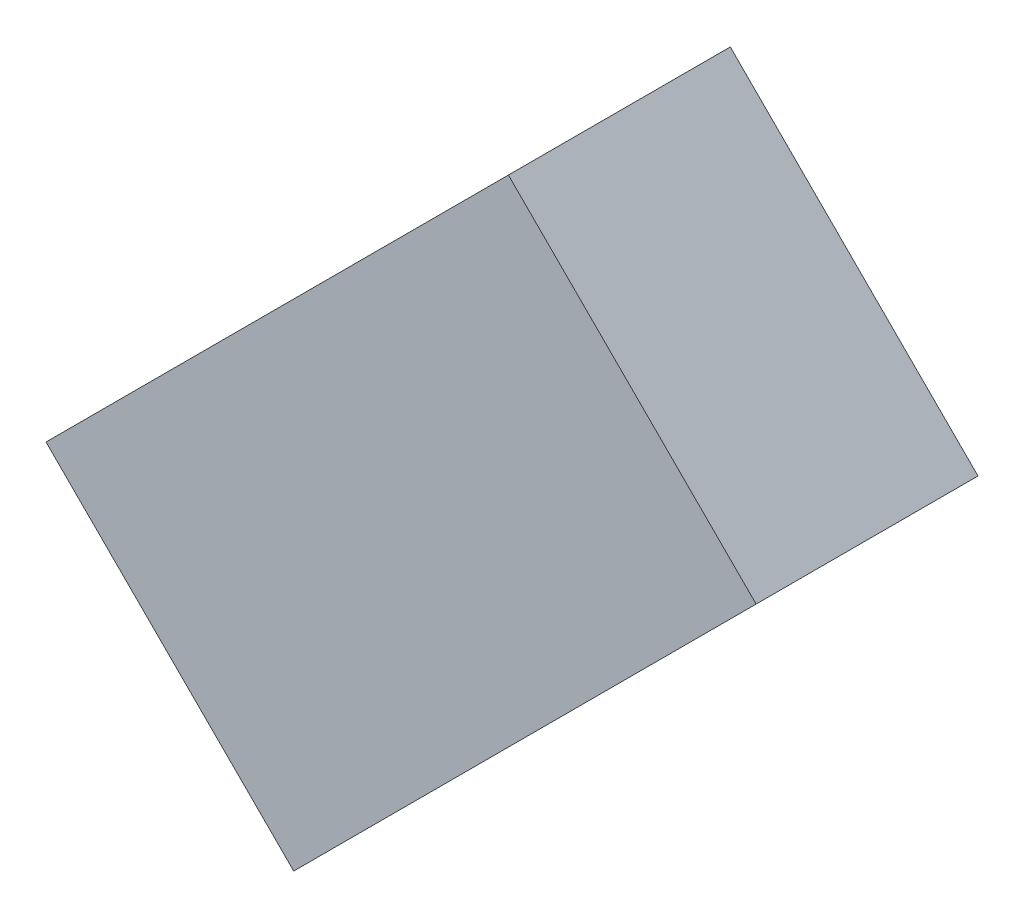
ISO-10303-21;
HEADER;
FILE_DESCRIPTION(('STEP AP214'),'2;1');
FILE_NAME('part.step','',(''),(''),'','','');
FILE_SCHEMA(('AUTOMOTIVE_DESIGN { 1 0 10303 214 1 1 1 1 }'));
ENDSEC;
DATA;
#1=APPLICATION_CONTEXT('core data for automotive mechanical design processes');
#2=APPLICATION_PROTOCOL_DEFINITION('international standard','automotive_design',2000,#1);
#3=PRODUCT_CONTEXT('',#1,'mechanical');
#4=PRODUCT('Part','Part','',(#3));
#5=PRODUCT_RELATED_PRODUCT_CATEGORY('part','',(#4));
#6=PRODUCT_DEFINITION_FORMATION('','',#4);
#7=PRODUCT_DEFINITION_CONTEXT('part definition',#1,'design');
#8=PRODUCT_DEFINITION('design','',#6,#7);
#9=PRODUCT_DEFINITION_SHAPE('','',#8);
#10=(LENGTH_UNIT() NAMED_UNIT(*) SI_UNIT(.MILLI.,.METRE.));
#11=(NAMED_UNIT(*) PLANE_ANGLE_UNIT() SI_UNIT($,.RADIAN.));
#12=(NAMED_UNIT(*) SI_UNIT($,.STERADIAN.) SOLID_ANGLE_UNIT());
#13=UNCERTAINTY_MEASURE_WITH_UNIT(LENGTH_MEASURE(1.E-05),#10,'distance_accuracy_value','');
#14=(GEOMETRIC_REPRESENTATION_CONTEXT(3) GLOBAL_UNCERTAINTY_ASSIGNED_CONTEXT((#13)) GLOBAL_UNIT_ASSIGNED_CONTEXT((#10,
#11,#12)) REPRESENTATION_CONTEXT('',''));
#15=CARTESIAN_POINT('',(0.,0.,0.));
#16=DIRECTION('',(0.,0.,1.));
#17=DIRECTION('',(1.,0.,0.));
#18=AXIS2_PLACEMENT_3D('',#15,#16,#17);
#19=CARTESIAN_POINT('',(7.707,8.644,0.81916));
#20=DIRECTION('',(0.,0.,1.));
#21=DIRECTION('',(1.,0.,0.));
#22=AXIS2_PLACEMENT_3D('',#19,#20,#21);
#23=PLANE('',#22);
#24=DIRECTION('',(0.707106781186548,-0.707106781186548,0.));
#25=VECTOR('',#24,1.);
#26=CARTESIAN_POINT('',(8.01105591591,8.735923881554,0.81916));
#27=LINE('',#26,#25);
#28=CARTESIAN_POINT('',(7.798923881554,8.94805591591,0.81916));
#29=VERTEX_POINT('',#28);
#30=CARTESIAN_POINT('',(8.01105591591,8.735923881554,0.81916));
#31=VERTEX_POINT('',#30);
#32=EDGE_CURVE('E81',#29,#31,#27,.T.);
#33=ORIENTED_EDGE('',*,*,#32,.T.);
#34=DIRECTION('',(-0.707106781186548,-0.707106781186548,0.));
#35=VECTOR('',#34,1.);
#36=CARTESIAN_POINT('',(7.615076118446,8.33994408409,0.81916));
#37=LINE('',#36,#35);
#38=CARTESIAN_POINT('',(7.615076118446,8.33994408409,0.81916));
#39=VERTEX_POINT('',#38);
#40=EDGE_CURVE('E68',#31,#39,#37,.T.);
#41=ORIENTED_EDGE('',*,*,#40,.T.);
#42=DIRECTION('',(-0.707106781186548,0.707106781186548,0.));
#43=VECTOR('',#42,1.);
#44=CARTESIAN_POINT('',(7.615076118446,8.33994408409,0.81916));
#45=LINE('',#44,#43);
#46=CARTESIAN_POINT('',(7.40294408409,8.552076118446,0.81916));
#47=VERTEX_POINT('',#46);
#48=EDGE_CURVE('E55',#39,#47,#45,.T.);
#49=ORIENTED_EDGE('',*,*,#48,.T.);
#50=DIRECTION('',(0.707106781186548,0.707106781186548,0.));
#51=VECTOR('',#50,1.);
#52=CARTESIAN_POINT('',(7.40294408409,8.552076118446,0.81916));
#53=LINE('',#52,#51);
#54=EDGE_CURVE('E20',#47,#29,#53,.T.);
#55=ORIENTED_EDGE('',*,*,#54,.T.);
#56=EDGE_LOOP('',(#33,#41,#49,#55));
#57=FACE_BOUND('',#56,.T.);
#58=ADVANCED_FACE('F17',(#57),#23,.F.);
#59=CARTESIAN_POINT('',(7.40294408409,8.552076118446,1.00916));
#60=DIRECTION('',(0.707106781186548,-0.707106781186548,0.));
#61=DIRECTION('',(0.707106781186548,0.707106781186548,0.));
#62=AXIS2_PLACEMENT_3D('',#59,#60,#61);
#63=PLANE('',#62);
#64=DIRECTION('',(0.,0.,1.));
#65=VECTOR('',#64,1.);
#66=CARTESIAN_POINT('',(7.40294408409,8.552076118446,1.00916));
#67=LINE('',#66,#65);
#68=CARTESIAN_POINT('',(7.40294408409,8.552076118446,1.00916));
#69=VERTEX_POINT('',#68);
#70=EDGE_CURVE('E61',#47,#69,#67,.T.);
#71=ORIENTED_EDGE('',*,*,#70,.T.);
#72=DIRECTION('',(-0.707106781186547,-0.707106781186547,0.));
#73=VECTOR('',#72,1.);
#74=CARTESIAN_POINT('',(7.798923881554,8.94805591591,1.00916));
#75=LINE('',#74,#73);
#76=CARTESIAN_POINT('',(7.798923881554,8.94805591591,1.00916));
#77=VERTEX_POINT('',#76);
#78=EDGE_CURVE('E83',#77,#69,#75,.T.);
#79=ORIENTED_EDGE('',*,*,#78,.F.);
#80=DIRECTION('',(0.,0.,1.));
#81=VECTOR('',#80,1.);
#82=CARTESIAN_POINT('',(7.798923881554,8.94805591591,1.00916));
#83=LINE('',#82,#81);
#84=EDGE_CURVE('E64',#77,#29,#83,.F.);
#85=ORIENTED_EDGE('',*,*,#84,.T.);
#86=ORIENTED_EDGE('',*,*,#54,.F.);
#87=EDGE_LOOP('',(#71,#79,#85,#86));
#88=FACE_BOUND('',#87,.T.);
#89=ADVANCED_FACE('F60',(#88),#63,.F.);
#90=CARTESIAN_POINT('',(7.615076118446,8.33994408409,1.00916));
#91=DIRECTION('',(0.707106781186548,0.707106781186548,0.));
#92=DIRECTION('',(-0.707106781186548,0.707106781186548,0.));
#93=AXIS2_PLACEMENT_3D('',#90,#91,#92);
#94=PLANE('',#93);
#95=DIRECTION('',(0.,0.,1.));
#96=VECTOR('',#95,1.);
#97=CARTESIAN_POINT('',(7.615076118446,8.33994408409,1.00916));
#98=LINE('',#97,#96);
#99=CARTESIAN_POINT('',(7.615076118446,8.33994408409,1.00916));
#100=VERTEX_POINT('',#99);
#101=EDGE_CURVE('E70',#39,#100,#98,.T.);
#102=ORIENTED_EDGE('',*,*,#101,.T.);
#103=DIRECTION('',(0.707106781186549,-0.707106781186546,0.));
#104=VECTOR('',#103,1.);
#105=CARTESIAN_POINT('',(7.40294408409,8.552076118446,1.00916));
#106=LINE('',#105,#104);
#107=EDGE_CURVE('E74',#69,#100,#106,.T.);
#108=ORIENTED_EDGE('',*,*,#107,.F.);
#109=ORIENTED_EDGE('',*,*,#70,.F.);
#110=ORIENTED_EDGE('',*,*,#48,.F.);
#111=EDGE_LOOP('',(#102,#108,#109,#110));
#112=FACE_BOUND('',#111,.T.);
#113=ADVANCED_FACE('F72',(#112),#94,.F.);
#114=CARTESIAN_POINT('',(7.615076118446,8.33994408409,1.00916));
#115=DIRECTION('',(-0.707106781186548,0.707106781186548,0.));
#116=DIRECTION('',(-0.707106781186548,-0.707106781186548,0.));
#117=AXIS2_PLACEMENT_3D('',#114,#115,#116);
#118=PLANE('',#117);
#119=DIRECTION('',(0.,0.,1.));
#120=VECTOR('',#119,1.);
#121=CARTESIAN_POINT('',(8.01105591591,8.735923881554,1.00916));
#122=LINE('',#121,#120);
#123=CARTESIAN_POINT('',(8.01105591591,8.735923881554,1.00916));
#124=VERTEX_POINT('',#123);
#125=EDGE_CURVE('E35',#31,#124,#122,.T.);
#126=ORIENTED_EDGE('',*,*,#125,.T.);
#127=DIRECTION('',(0.707106781186549,0.707106781186546,0.));
#128=VECTOR('',#127,1.);
#129=CARTESIAN_POINT('',(7.615076118446,8.33994408409,1.00916));
#130=LINE('',#129,#128);
#131=EDGE_CURVE('E26',#100,#124,#130,.T.);
#132=ORIENTED_EDGE('',*,*,#131,.F.);
#133=ORIENTED_EDGE('',*,*,#101,.F.);
#134=ORIENTED_EDGE('',*,*,#40,.F.);
#135=EDGE_LOOP('',(#126,#132,#133,#134));
#136=FACE_BOUND('',#135,.T.);
#137=ADVANCED_FACE('F89',(#136),#118,.F.);
#138=CARTESIAN_POINT('',(8.01105591591,8.735923881554,1.00916));
#139=DIRECTION('',(-0.707106781186548,-0.707106781186548,0.));
#140=DIRECTION('',(0.707106781186548,-0.707106781186548,0.));
#141=AXIS2_PLACEMENT_3D('',#138,#139,#140);
#142=PLANE('',#141);
#143=ORIENTED_EDGE('',*,*,#84,.F.);
#144=DIRECTION('',(-0.707106781186546,0.707106781186549,0.));
#145=VECTOR('',#144,1.);
#146=CARTESIAN_POINT('',(8.01105591591,8.735923881554,1.00916));
#147=LINE('',#146,#145);
#148=EDGE_CURVE('E11',#124,#77,#147,.T.);
#149=ORIENTED_EDGE('',*,*,#148,.F.);
#150=ORIENTED_EDGE('',*,*,#125,.F.);
#151=ORIENTED_EDGE('',*,*,#32,.F.);
#152=EDGE_LOOP('',(#143,#149,#150,#151));
#153=FACE_BOUND('',#152,.T.);
#154=ADVANCED_FACE('F91',(#153),#142,.F.);
#155=CARTESIAN_POINT('',(7.707,8.644,1.00916));
#156=DIRECTION('',(0.,0.,1.));
#157=DIRECTION('',(1.,0.,0.));
#158=AXIS2_PLACEMENT_3D('',#155,#156,#157);
#159=PLANE('',#158);
#160=ORIENTED_EDGE('',*,*,#131,.T.);
#161=ORIENTED_EDGE('',*,*,#148,.T.);
#162=ORIENTED_EDGE('',*,*,#78,.T.);
#163=ORIENTED_EDGE('',*,*,#107,.T.);
#164=EDGE_LOOP('',(#160,#161,#162,#163));
#165=FACE_BOUND('',#164,.T.);
#166=ADVANCED_FACE('F88',(#165),#159,.T.);
#167=CLOSED_SHELL('',(#58,#89,#113,#137,#154,#166));
#168=MANIFOLD_SOLID_BREP('B1',#167);
#169=ADVANCED_BREP_SHAPE_REPRESENTATION('',(#18,#168),#14);
#170=SHAPE_DEFINITION_REPRESENTATION(#9,#169);
ENDSEC;
END-ISO-10303-21;
